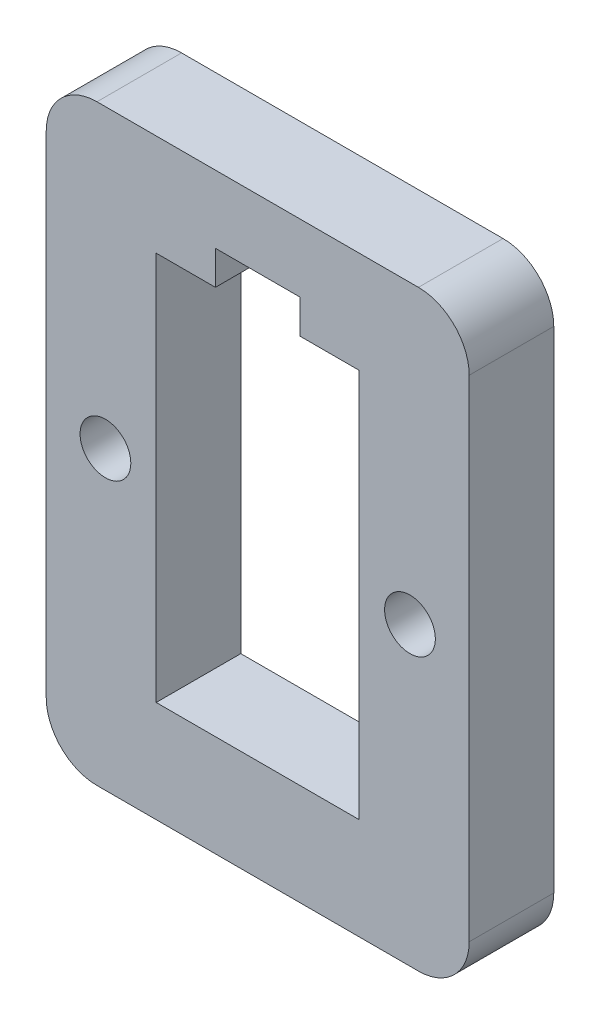
ISO-10303-21;
HEADER;
FILE_DESCRIPTION(('STEP AP214'),'2;1');
FILE_NAME('part.step','',(''),(''),'','','');
FILE_SCHEMA(('AUTOMOTIVE_DESIGN { 1 0 10303 214 1 1 1 1 }'));
ENDSEC;
DATA;
#1=APPLICATION_CONTEXT('core data for automotive mechanical design processes');
#2=APPLICATION_PROTOCOL_DEFINITION('international standard','automotive_design',2000,#1);
#3=PRODUCT_CONTEXT('',#1,'mechanical');
#4=PRODUCT('Part','Part','',(#3));
#5=PRODUCT_RELATED_PRODUCT_CATEGORY('part','',(#4));
#6=PRODUCT_DEFINITION_FORMATION('','',#4);
#7=PRODUCT_DEFINITION_CONTEXT('part definition',#1,'design');
#8=PRODUCT_DEFINITION('design','',#6,#7);
#9=PRODUCT_DEFINITION_SHAPE('','',#8);
#10=(LENGTH_UNIT() NAMED_UNIT(*) SI_UNIT(.MILLI.,.METRE.));
#11=(NAMED_UNIT(*) PLANE_ANGLE_UNIT() SI_UNIT($,.RADIAN.));
#12=(NAMED_UNIT(*) SI_UNIT($,.STERADIAN.) SOLID_ANGLE_UNIT());
#13=UNCERTAINTY_MEASURE_WITH_UNIT(LENGTH_MEASURE(1.E-05),#10,'distance_accuracy_value','');
#14=(GEOMETRIC_REPRESENTATION_CONTEXT(3) GLOBAL_UNCERTAINTY_ASSIGNED_CONTEXT((#13)) GLOBAL_UNIT_ASSIGNED_CONTEXT((#10,
#11,#12)) REPRESENTATION_CONTEXT('',''));
#15=CARTESIAN_POINT('',(0.,0.,0.));
#16=DIRECTION('',(0.,0.,1.));
#17=DIRECTION('',(1.,0.,0.));
#18=AXIS2_PLACEMENT_3D('',#15,#16,#17);
#19=CARTESIAN_POINT('',(2332.44024545616,1566.10008841039,5.));
#20=DIRECTION('',(0.,0.,1.));
#21=DIRECTION('',(1.,0.,0.));
#22=AXIS2_PLACEMENT_3D('',#19,#20,#21);
#23=PLANE('',#22);
#24=CARTESIAN_POINT('',(2313.94024545449,1580.60008840873,5.));
#25=DIRECTION('',(0.,0.,1.));
#26=DIRECTION('',(1.,0.,0.));
#27=AXIS2_PLACEMENT_3D('',#24,#25,#26);
#28=CIRCLE('',#27,1.50000000166674);
#29=CARTESIAN_POINT('',(2315.44024545616,1580.60008840873,5.));
#30=VERTEX_POINT('',#29);
#31=EDGE_CURVE('E201',#30,#30,#28,.T.);
#32=ORIENTED_EDGE('',*,*,#31,.F.);
#33=EDGE_LOOP('',(#32));
#34=FACE_BOUND('',#33,.T.);
#35=CARTESIAN_POINT('',(2332.44024545616,1566.10008841039,5.));
#36=DIRECTION('',(0.,0.,1.));
#37=DIRECTION('',(1.,0.,0.));
#38=AXIS2_PLACEMENT_3D('',#35,#36,#37);
#39=CIRCLE('',#38,3.00000000000011);
#40=CARTESIAN_POINT('',(2332.44024545616,1563.10008841039,5.));
#41=VERTEX_POINT('',#40);
#42=CARTESIAN_POINT('',(2335.44024545616,1566.10008841039,5.));
#43=VERTEX_POINT('',#42);
#44=EDGE_CURVE('E245',#41,#43,#39,.T.);
#45=ORIENTED_EDGE('',*,*,#44,.T.);
#46=DIRECTION('',(0.,1.,0.));
#47=VECTOR('',#46,1.);
#48=CARTESIAN_POINT('',(2335.44024545616,1595.10008841039,5.));
#49=LINE('',#48,#47);
#50=CARTESIAN_POINT('',(2335.44024545616,1595.10008841039,5.));
#51=VERTEX_POINT('',#50);
#52=EDGE_CURVE('E249',#43,#51,#49,.T.);
#53=ORIENTED_EDGE('',*,*,#52,.T.);
#54=CARTESIAN_POINT('',(2332.44024545616,1595.10008841039,5.));
#55=DIRECTION('',(0.,0.,1.));
#56=DIRECTION('',(1.,0.,0.));
#57=AXIS2_PLACEMENT_3D('',#54,#55,#56);
#58=CIRCLE('',#57,3.00000000000011);
#59=CARTESIAN_POINT('',(2332.44024545616,1598.10008841039,5.));
#60=VERTEX_POINT('',#59);
#61=EDGE_CURVE('E253',#51,#60,#58,.T.);
#62=ORIENTED_EDGE('',*,*,#61,.T.);
#63=DIRECTION('',(-1.,0.,0.));
#64=VECTOR('',#63,1.);
#65=CARTESIAN_POINT('',(2313.44024545616,1598.10008841039,5.));
#66=LINE('',#65,#64);
#67=CARTESIAN_POINT('',(2313.44024545616,1598.10008841039,5.));
#68=VERTEX_POINT('',#67);
#69=EDGE_CURVE('E256',#60,#68,#66,.T.);
#70=ORIENTED_EDGE('',*,*,#69,.T.);
#71=CARTESIAN_POINT('',(2313.44024545616,1595.10008841039,5.));
#72=DIRECTION('',(0.,0.,1.));
#73=DIRECTION('',(1.,0.,0.));
#74=AXIS2_PLACEMENT_3D('',#71,#72,#73);
#75=CIRCLE('',#74,3.00000000000011);
#76=CARTESIAN_POINT('',(2310.44024545616,1595.10008841039,5.));
#77=VERTEX_POINT('',#76);
#78=EDGE_CURVE('E259',#68,#77,#75,.T.);
#79=ORIENTED_EDGE('',*,*,#78,.T.);
#80=DIRECTION('',(0.,-1.,0.));
#81=VECTOR('',#80,1.);
#82=CARTESIAN_POINT('',(2310.44024545616,1566.10008841039,5.));
#83=LINE('',#82,#81);
#84=CARTESIAN_POINT('',(2310.44024545616,1566.10008841039,5.));
#85=VERTEX_POINT('',#84);
#86=EDGE_CURVE('E262',#77,#85,#83,.T.);
#87=ORIENTED_EDGE('',*,*,#86,.T.);
#88=CARTESIAN_POINT('',(2313.44024545616,1566.10008841039,5.));
#89=DIRECTION('',(0.,0.,1.));
#90=DIRECTION('',(1.,0.,0.));
#91=AXIS2_PLACEMENT_3D('',#88,#89,#90);
#92=CIRCLE('',#91,3.00000000000011);
#93=CARTESIAN_POINT('',(2313.44024545616,1563.10008841039,5.));
#94=VERTEX_POINT('',#93);
#95=EDGE_CURVE('E265',#85,#94,#92,.T.);
#96=ORIENTED_EDGE('',*,*,#95,.T.);
#97=DIRECTION('',(1.,0.,0.));
#98=VECTOR('',#97,1.);
#99=CARTESIAN_POINT('',(2332.44024545616,1563.10008841039,5.));
#100=LINE('',#99,#98);
#101=EDGE_CURVE('E268',#94,#41,#100,.T.);
#102=ORIENTED_EDGE('',*,*,#101,.T.);
#103=EDGE_LOOP('',(#45,#53,#62,#70,#79,#87,#96,#102));
#104=FACE_BOUND('',#103,.T.);
#105=DIRECTION('',(1.,0.,0.));
#106=VECTOR('',#105,1.);
#107=CARTESIAN_POINT('',(2316.94024545616,1569.10008841039,5.));
#108=LINE('',#107,#106);
#109=CARTESIAN_POINT('',(2316.94024545616,1569.10008841039,5.));
#110=VERTEX_POINT('',#109);
#111=CARTESIAN_POINT('',(2328.94024545616,1569.10008841039,5.));
#112=VERTEX_POINT('',#111);
#113=EDGE_CURVE('E162',#110,#112,#108,.T.);
#114=ORIENTED_EDGE('',*,*,#113,.F.);
#115=DIRECTION('',(0.,-1.,0.));
#116=VECTOR('',#115,1.);
#117=CARTESIAN_POINT('',(2316.94024545616,1592.10008841039,5.));
#118=LINE('',#117,#116);
#119=CARTESIAN_POINT('',(2316.94024545616,1592.10008841039,5.));
#120=VERTEX_POINT('',#119);
#121=EDGE_CURVE('E153',#120,#110,#118,.T.);
#122=ORIENTED_EDGE('',*,*,#121,.F.);
#123=DIRECTION('',(-1.,0.,0.));
#124=VECTOR('',#123,1.);
#125=CARTESIAN_POINT('',(2320.44024545616,1592.10008841039,5.));
#126=LINE('',#125,#124);
#127=CARTESIAN_POINT('',(2320.44024545616,1592.10008841039,5.));
#128=VERTEX_POINT('',#127);
#129=EDGE_CURVE('E196',#128,#120,#126,.T.);
#130=ORIENTED_EDGE('',*,*,#129,.F.);
#131=DIRECTION('',(0.,-1.,0.));
#132=VECTOR('',#131,1.);
#133=CARTESIAN_POINT('',(2320.44024545616,1594.10018841039,5.));
#134=LINE('',#133,#132);
#135=CARTESIAN_POINT('',(2320.44024545616,1594.10018841039,5.));
#136=VERTEX_POINT('',#135);
#137=EDGE_CURVE('E193',#136,#128,#134,.T.);
#138=ORIENTED_EDGE('',*,*,#137,.F.);
#139=DIRECTION('',(-1.,0.,0.));
#140=VECTOR('',#139,1.);
#141=CARTESIAN_POINT('',(2325.44024545616,1594.10018841039,5.));
#142=LINE('',#141,#140);
#143=CARTESIAN_POINT('',(2325.44024545616,1594.10018841039,5.));
#144=VERTEX_POINT('',#143);
#145=EDGE_CURVE('E190',#144,#136,#142,.T.);
#146=ORIENTED_EDGE('',*,*,#145,.F.);
#147=DIRECTION('',(0.,1.,0.));
#148=VECTOR('',#147,1.);
#149=CARTESIAN_POINT('',(2325.44024545616,1592.10008841039,5.));
#150=LINE('',#149,#148);
#151=CARTESIAN_POINT('',(2325.44024545616,1592.10008841039,5.));
#152=VERTEX_POINT('',#151);
#153=EDGE_CURVE('E187',#152,#144,#150,.T.);
#154=ORIENTED_EDGE('',*,*,#153,.F.);
#155=DIRECTION('',(-1.,0.,0.));
#156=VECTOR('',#155,1.);
#157=CARTESIAN_POINT('',(2328.94024545616,1592.10008841039,5.));
#158=LINE('',#157,#156);
#159=CARTESIAN_POINT('',(2328.94024545616,1592.10008841039,5.));
#160=VERTEX_POINT('',#159);
#161=EDGE_CURVE('E181',#160,#152,#158,.T.);
#162=ORIENTED_EDGE('',*,*,#161,.F.);
#163=DIRECTION('',(0.,1.,0.));
#164=VECTOR('',#163,1.);
#165=CARTESIAN_POINT('',(2328.94024545616,1569.10008841039,5.));
#166=LINE('',#165,#164);
#167=EDGE_CURVE('E177',#112,#160,#166,.T.);
#168=ORIENTED_EDGE('',*,*,#167,.F.);
#169=EDGE_LOOP('',(#114,#122,#130,#138,#146,#154,#162,#168));
#170=FACE_BOUND('',#169,.T.);
#171=CARTESIAN_POINT('',(2331.94024545449,1580.60008840873,5.));
#172=DIRECTION('',(0.,0.,1.));
#173=DIRECTION('',(1.,0.,0.));
#174=AXIS2_PLACEMENT_3D('',#171,#172,#173);
#175=CIRCLE('',#174,1.50000000166674);
#176=CARTESIAN_POINT('',(2333.44024545616,1580.60008840873,5.));
#177=VERTEX_POINT('',#176);
#178=EDGE_CURVE('E424',#177,#177,#175,.T.);
#179=ORIENTED_EDGE('',*,*,#178,.F.);
#180=EDGE_LOOP('',(#179));
#181=FACE_BOUND('',#180,.T.);
#182=ADVANCED_FACE('F39',(#34,#104,#170,#181),#23,.T.);
#183=CARTESIAN_POINT('',(2332.44024545616,1566.10008841039,0.));
#184=DIRECTION('',(0.,0.,1.));
#185=DIRECTION('',(1.,0.,0.));
#186=AXIS2_PLACEMENT_3D('',#183,#184,#185);
#187=PLANE('',#186);
#188=CARTESIAN_POINT('',(2332.44024545616,1566.10008841039,0.));
#189=DIRECTION('',(0.,0.,1.));
#190=DIRECTION('',(1.,0.,0.));
#191=AXIS2_PLACEMENT_3D('',#188,#189,#190);
#192=CIRCLE('',#191,3.00000000000011);
#193=CARTESIAN_POINT('',(2332.44024545616,1563.10008841039,0.));
#194=VERTEX_POINT('',#193);
#195=CARTESIAN_POINT('',(2335.44024545616,1566.10008841039,0.));
#196=VERTEX_POINT('',#195);
#197=EDGE_CURVE('E171',#194,#196,#192,.T.);
#198=ORIENTED_EDGE('',*,*,#197,.F.);
#199=DIRECTION('',(1.,0.,0.));
#200=VECTOR('',#199,1.);
#201=CARTESIAN_POINT('',(2332.44024545616,1563.10008841039,0.));
#202=LINE('',#201,#200);
#203=CARTESIAN_POINT('',(2313.44024545616,1563.10008841039,0.));
#204=VERTEX_POINT('',#203);
#205=EDGE_CURVE('E250',#204,#194,#202,.T.);
#206=ORIENTED_EDGE('',*,*,#205,.F.);
#207=CARTESIAN_POINT('',(2313.44024545616,1566.10008841039,0.));
#208=DIRECTION('',(0.,0.,1.));
#209=DIRECTION('',(1.,0.,0.));
#210=AXIS2_PLACEMENT_3D('',#207,#208,#209);
#211=CIRCLE('',#210,3.00000000000011);
#212=CARTESIAN_POINT('',(2310.44024545616,1566.10008841039,0.));
#213=VERTEX_POINT('',#212);
#214=EDGE_CURVE('E290',#213,#204,#211,.T.);
#215=ORIENTED_EDGE('',*,*,#214,.F.);
#216=DIRECTION('',(0.,-1.,0.));
#217=VECTOR('',#216,1.);
#218=CARTESIAN_POINT('',(2310.44024545616,1566.10008841039,0.));
#219=LINE('',#218,#217);
#220=CARTESIAN_POINT('',(2310.44024545616,1595.10008841039,0.));
#221=VERTEX_POINT('',#220);
#222=EDGE_CURVE('E287',#221,#213,#219,.T.);
#223=ORIENTED_EDGE('',*,*,#222,.F.);
#224=CARTESIAN_POINT('',(2313.44024545616,1595.10008841039,0.));
#225=DIRECTION('',(0.,0.,1.));
#226=DIRECTION('',(1.,0.,0.));
#227=AXIS2_PLACEMENT_3D('',#224,#225,#226);
#228=CIRCLE('',#227,3.00000000000011);
#229=CARTESIAN_POINT('',(2313.44024545616,1598.10008841039,0.));
#230=VERTEX_POINT('',#229);
#231=EDGE_CURVE('E284',#230,#221,#228,.T.);
#232=ORIENTED_EDGE('',*,*,#231,.F.);
#233=DIRECTION('',(-1.,0.,0.));
#234=VECTOR('',#233,1.);
#235=CARTESIAN_POINT('',(2313.44024545616,1598.10008841039,0.));
#236=LINE('',#235,#234);
#237=CARTESIAN_POINT('',(2332.44024545616,1598.10008841039,0.));
#238=VERTEX_POINT('',#237);
#239=EDGE_CURVE('E281',#238,#230,#236,.T.);
#240=ORIENTED_EDGE('',*,*,#239,.F.);
#241=CARTESIAN_POINT('',(2332.44024545616,1595.10008841039,0.));
#242=DIRECTION('',(0.,0.,1.));
#243=DIRECTION('',(1.,0.,0.));
#244=AXIS2_PLACEMENT_3D('',#241,#242,#243);
#245=CIRCLE('',#244,3.00000000000011);
#246=CARTESIAN_POINT('',(2335.44024545616,1595.10008841039,0.));
#247=VERTEX_POINT('',#246);
#248=EDGE_CURVE('E278',#247,#238,#245,.T.);
#249=ORIENTED_EDGE('',*,*,#248,.F.);
#250=DIRECTION('',(0.,1.,0.));
#251=VECTOR('',#250,1.);
#252=CARTESIAN_POINT('',(2335.44024545616,1595.10008841039,0.));
#253=LINE('',#252,#251);
#254=EDGE_CURVE('E275',#196,#247,#253,.T.);
#255=ORIENTED_EDGE('',*,*,#254,.F.);
#256=EDGE_LOOP('',(#198,#206,#215,#223,#232,#240,#249,#255));
#257=FACE_BOUND('',#256,.T.);
#258=DIRECTION('',(0.,-1.,0.));
#259=VECTOR('',#258,1.);
#260=CARTESIAN_POINT('',(2316.94024545616,1592.10008841039,0.));
#261=LINE('',#260,#259);
#262=CARTESIAN_POINT('',(2316.94024545616,1592.10008841039,0.));
#263=VERTEX_POINT('',#262);
#264=CARTESIAN_POINT('',(2316.94024545616,1569.10008841039,0.));
#265=VERTEX_POINT('',#264);
#266=EDGE_CURVE('E63',#263,#265,#261,.T.);
#267=ORIENTED_EDGE('',*,*,#266,.T.);
#268=DIRECTION('',(1.,0.,0.));
#269=VECTOR('',#268,1.);
#270=CARTESIAN_POINT('',(2316.94024545616,1569.10008841039,0.));
#271=LINE('',#270,#269);
#272=CARTESIAN_POINT('',(2328.94024545616,1569.10008841039,0.));
#273=VERTEX_POINT('',#272);
#274=EDGE_CURVE('E169',#265,#273,#271,.T.);
#275=ORIENTED_EDGE('',*,*,#274,.T.);
#276=DIRECTION('',(0.,1.,0.));
#277=VECTOR('',#276,1.);
#278=CARTESIAN_POINT('',(2328.94024545616,1569.10008841039,0.));
#279=LINE('',#278,#277);
#280=CARTESIAN_POINT('',(2328.94024545616,1592.10008841039,0.));
#281=VERTEX_POINT('',#280);
#282=EDGE_CURVE('E204',#273,#281,#279,.T.);
#283=ORIENTED_EDGE('',*,*,#282,.T.);
#284=DIRECTION('',(-1.,0.,0.));
#285=VECTOR('',#284,1.);
#286=CARTESIAN_POINT('',(2328.94024545616,1592.10008841039,0.));
#287=LINE('',#286,#285);
#288=CARTESIAN_POINT('',(2325.44024545616,1592.10008841039,0.));
#289=VERTEX_POINT('',#288);
#290=EDGE_CURVE('E208',#281,#289,#287,.T.);
#291=ORIENTED_EDGE('',*,*,#290,.T.);
#292=DIRECTION('',(0.,1.,0.));
#293=VECTOR('',#292,1.);
#294=CARTESIAN_POINT('',(2325.44024545616,1592.10008841039,0.));
#295=LINE('',#294,#293);
#296=CARTESIAN_POINT('',(2325.44024545616,1594.10018841039,0.));
#297=VERTEX_POINT('',#296);
#298=EDGE_CURVE('E212',#289,#297,#295,.T.);
#299=ORIENTED_EDGE('',*,*,#298,.T.);
#300=DIRECTION('',(-1.,0.,0.));
#301=VECTOR('',#300,1.);
#302=CARTESIAN_POINT('',(2325.44024545616,1594.10018841039,0.));
#303=LINE('',#302,#301);
#304=CARTESIAN_POINT('',(2320.44024545616,1594.10018841039,0.));
#305=VERTEX_POINT('',#304);
#306=EDGE_CURVE('E216',#297,#305,#303,.T.);
#307=ORIENTED_EDGE('',*,*,#306,.T.);
#308=DIRECTION('',(0.,-1.,0.));
#309=VECTOR('',#308,1.);
#310=CARTESIAN_POINT('',(2320.44024545616,1594.10018841039,0.));
#311=LINE('',#310,#309);
#312=CARTESIAN_POINT('',(2320.44024545616,1592.10008841039,0.));
#313=VERTEX_POINT('',#312);
#314=EDGE_CURVE('E220',#305,#313,#311,.T.);
#315=ORIENTED_EDGE('',*,*,#314,.T.);
#316=DIRECTION('',(-1.,0.,0.));
#317=VECTOR('',#316,1.);
#318=CARTESIAN_POINT('',(2320.44024545616,1592.10008841039,0.));
#319=LINE('',#318,#317);
#320=EDGE_CURVE('E163',#313,#263,#319,.T.);
#321=ORIENTED_EDGE('',*,*,#320,.T.);
#322=EDGE_LOOP('',(#267,#275,#283,#291,#299,#307,#315,#321));
#323=FACE_BOUND('',#322,.T.);
#324=CARTESIAN_POINT('',(2313.94024545449,1580.60008840873,0.));
#325=DIRECTION('',(0.,0.,1.));
#326=DIRECTION('',(1.,0.,0.));
#327=AXIS2_PLACEMENT_3D('',#324,#325,#326);
#328=CIRCLE('',#327,1.50000000166674);
#329=CARTESIAN_POINT('',(2315.44024545616,1580.60008840873,0.));
#330=VERTEX_POINT('',#329);
#331=EDGE_CURVE('E432',#330,#330,#328,.T.);
#332=ORIENTED_EDGE('',*,*,#331,.T.);
#333=EDGE_LOOP('',(#332));
#334=FACE_BOUND('',#333,.T.);
#335=CARTESIAN_POINT('',(2331.94024545449,1580.60008840873,0.));
#336=DIRECTION('',(0.,0.,1.));
#337=DIRECTION('',(1.,0.,0.));
#338=AXIS2_PLACEMENT_3D('',#335,#336,#337);
#339=CIRCLE('',#338,1.50000000166674);
#340=CARTESIAN_POINT('',(2333.44024545616,1580.60008840873,0.));
#341=VERTEX_POINT('',#340);
#342=EDGE_CURVE('E427',#341,#341,#339,.T.);
#343=ORIENTED_EDGE('',*,*,#342,.T.);
#344=EDGE_LOOP('',(#343));
#345=FACE_BOUND('',#344,.T.);
#346=ADVANCED_FACE('F329',(#257,#323,#334,#345),#187,.F.);
#347=CARTESIAN_POINT('',(2332.44024545616,1566.10008841039,5.));
#348=DIRECTION('',(0.,0.,-1.));
#349=DIRECTION('',(-1.,0.,0.));
#350=AXIS2_PLACEMENT_3D('',#347,#348,#349);
#351=CYLINDRICAL_SURFACE('',#350,3.00000000000011);
#352=ORIENTED_EDGE('',*,*,#197,.T.);
#353=DIRECTION('',(0.,0.,-1.));
#354=VECTOR('',#353,1.);
#355=CARTESIAN_POINT('',(2335.44024545616,1566.10008841039,5.));
#356=LINE('',#355,#354);
#357=EDGE_CURVE('E11',#43,#196,#356,.T.);
#358=ORIENTED_EDGE('',*,*,#357,.F.);
#359=ORIENTED_EDGE('',*,*,#44,.F.);
#360=DIRECTION('',(0.,0.,-1.));
#361=VECTOR('',#360,1.);
#362=CARTESIAN_POINT('',(2332.44024545616,1563.10008841039,5.));
#363=LINE('',#362,#361);
#364=EDGE_CURVE('E271',#41,#194,#363,.T.);
#365=ORIENTED_EDGE('',*,*,#364,.T.);
#366=EDGE_LOOP('',(#352,#358,#359,#365));
#367=FACE_BOUND('',#366,.T.);
#368=ADVANCED_FACE('F41',(#367),#351,.T.);
#369=CARTESIAN_POINT('',(2335.44024545616,1595.10008841039,5.));
#370=DIRECTION('',(-1.,0.,0.));
#371=DIRECTION('',(0.,0.,1.));
#372=AXIS2_PLACEMENT_3D('',#369,#370,#371);
#373=PLANE('',#372);
#374=ORIENTED_EDGE('',*,*,#254,.T.);
#375=DIRECTION('',(0.,0.,-1.));
#376=VECTOR('',#375,1.);
#377=CARTESIAN_POINT('',(2335.44024545616,1595.10008841039,5.));
#378=LINE('',#377,#376);
#379=EDGE_CURVE('E48',#51,#247,#378,.T.);
#380=ORIENTED_EDGE('',*,*,#379,.F.);
#381=ORIENTED_EDGE('',*,*,#52,.F.);
#382=ORIENTED_EDGE('',*,*,#357,.T.);
#383=EDGE_LOOP('',(#374,#380,#381,#382));
#384=FACE_BOUND('',#383,.T.);
#385=ADVANCED_FACE('F346',(#384),#373,.F.);
#386=CARTESIAN_POINT('',(2332.44024545616,1595.10008841039,5.));
#387=DIRECTION('',(0.,0.,-1.));
#388=DIRECTION('',(-1.,0.,0.));
#389=AXIS2_PLACEMENT_3D('',#386,#387,#388);
#390=CYLINDRICAL_SURFACE('',#389,3.00000000000011);
#391=ORIENTED_EDGE('',*,*,#248,.T.);
#392=DIRECTION('',(0.,0.,-1.));
#393=VECTOR('',#392,1.);
#394=CARTESIAN_POINT('',(2332.44024545616,1598.10008841039,5.));
#395=LINE('',#394,#393);
#396=EDGE_CURVE('E314',#60,#238,#395,.T.);
#397=ORIENTED_EDGE('',*,*,#396,.F.);
#398=ORIENTED_EDGE('',*,*,#61,.F.);
#399=ORIENTED_EDGE('',*,*,#379,.T.);
#400=EDGE_LOOP('',(#391,#397,#398,#399));
#401=FACE_BOUND('',#400,.T.);
#402=ADVANCED_FACE('F323',(#401),#390,.T.);
#403=CARTESIAN_POINT('',(2313.44024545616,1598.10008841039,5.));
#404=DIRECTION('',(0.,-1.,0.));
#405=DIRECTION('',(0.,0.,-1.));
#406=AXIS2_PLACEMENT_3D('',#403,#404,#405);
#407=PLANE('',#406);
#408=ORIENTED_EDGE('',*,*,#239,.T.);
#409=DIRECTION('',(0.,0.,-1.));
#410=VECTOR('',#409,1.);
#411=CARTESIAN_POINT('',(2313.44024545616,1598.10008841039,5.));
#412=LINE('',#411,#410);
#413=EDGE_CURVE('E310',#68,#230,#412,.T.);
#414=ORIENTED_EDGE('',*,*,#413,.F.);
#415=ORIENTED_EDGE('',*,*,#69,.F.);
#416=ORIENTED_EDGE('',*,*,#396,.T.);
#417=EDGE_LOOP('',(#408,#414,#415,#416));
#418=FACE_BOUND('',#417,.T.);
#419=ADVANCED_FACE('F335',(#418),#407,.F.);
#420=CARTESIAN_POINT('',(2313.44024545616,1595.10008841039,5.));
#421=DIRECTION('',(0.,0.,-1.));
#422=DIRECTION('',(-1.,0.,0.));
#423=AXIS2_PLACEMENT_3D('',#420,#421,#422);
#424=CYLINDRICAL_SURFACE('',#423,3.00000000000011);
#425=ORIENTED_EDGE('',*,*,#231,.T.);
#426=DIRECTION('',(0.,0.,-1.));
#427=VECTOR('',#426,1.);
#428=CARTESIAN_POINT('',(2310.44024545616,1595.10008841039,5.));
#429=LINE('',#428,#427);
#430=EDGE_CURVE('E306',#77,#221,#429,.T.);
#431=ORIENTED_EDGE('',*,*,#430,.F.);
#432=ORIENTED_EDGE('',*,*,#78,.F.);
#433=ORIENTED_EDGE('',*,*,#413,.T.);
#434=EDGE_LOOP('',(#425,#431,#432,#433));
#435=FACE_BOUND('',#434,.T.);
#436=ADVANCED_FACE('F339',(#435),#424,.T.);
#437=CARTESIAN_POINT('',(2310.44024545616,1566.10008841039,5.));
#438=DIRECTION('',(1.,0.,0.));
#439=DIRECTION('',(0.,0.,-1.));
#440=AXIS2_PLACEMENT_3D('',#437,#438,#439);
#441=PLANE('',#440);
#442=ORIENTED_EDGE('',*,*,#222,.T.);
#443=DIRECTION('',(0.,0.,-1.));
#444=VECTOR('',#443,1.);
#445=CARTESIAN_POINT('',(2310.44024545616,1566.10008841039,5.));
#446=LINE('',#445,#444);
#447=EDGE_CURVE('E302',#85,#213,#446,.T.);
#448=ORIENTED_EDGE('',*,*,#447,.F.);
#449=ORIENTED_EDGE('',*,*,#86,.F.);
#450=ORIENTED_EDGE('',*,*,#430,.T.);
#451=EDGE_LOOP('',(#442,#448,#449,#450));
#452=FACE_BOUND('',#451,.T.);
#453=ADVANCED_FACE('F359',(#452),#441,.F.);
#454=CARTESIAN_POINT('',(2313.44024545616,1566.10008841039,5.));
#455=DIRECTION('',(0.,0.,-1.));
#456=DIRECTION('',(-1.,0.,0.));
#457=AXIS2_PLACEMENT_3D('',#454,#455,#456);
#458=CYLINDRICAL_SURFACE('',#457,3.00000000000011);
#459=ORIENTED_EDGE('',*,*,#214,.T.);
#460=DIRECTION('',(0.,0.,-1.));
#461=VECTOR('',#460,1.);
#462=CARTESIAN_POINT('',(2313.44024545616,1563.10008841039,5.));
#463=LINE('',#462,#461);
#464=EDGE_CURVE('E298',#94,#204,#463,.T.);
#465=ORIENTED_EDGE('',*,*,#464,.F.);
#466=ORIENTED_EDGE('',*,*,#95,.F.);
#467=ORIENTED_EDGE('',*,*,#447,.T.);
#468=EDGE_LOOP('',(#459,#465,#466,#467));
#469=FACE_BOUND('',#468,.T.);
#470=ADVANCED_FACE('F357',(#469),#458,.T.);
#471=CARTESIAN_POINT('',(2332.44024545616,1563.10008841039,5.));
#472=DIRECTION('',(0.,1.,0.));
#473=DIRECTION('',(0.,0.,1.));
#474=AXIS2_PLACEMENT_3D('',#471,#472,#473);
#475=PLANE('',#474);
#476=ORIENTED_EDGE('',*,*,#205,.T.);
#477=ORIENTED_EDGE('',*,*,#364,.F.);
#478=ORIENTED_EDGE('',*,*,#101,.F.);
#479=ORIENTED_EDGE('',*,*,#464,.T.);
#480=EDGE_LOOP('',(#476,#477,#478,#479));
#481=FACE_BOUND('',#480,.T.);
#482=ADVANCED_FACE('F352',(#481),#475,.F.);
#483=CARTESIAN_POINT('',(2316.94024545616,1592.10008841039,5.));
#484=DIRECTION('',(1.,0.,0.));
#485=DIRECTION('',(0.,0.,-1.));
#486=AXIS2_PLACEMENT_3D('',#483,#484,#485);
#487=PLANE('',#486);
#488=ORIENTED_EDGE('',*,*,#266,.F.);
#489=DIRECTION('',(0.,0.,-1.));
#490=VECTOR('',#489,1.);
#491=CARTESIAN_POINT('',(2316.94024545616,1592.10008841039,5.));
#492=LINE('',#491,#490);
#493=EDGE_CURVE('E157',#120,#263,#492,.T.);
#494=ORIENTED_EDGE('',*,*,#493,.F.);
#495=ORIENTED_EDGE('',*,*,#121,.T.);
#496=DIRECTION('',(0.,0.,-1.));
#497=VECTOR('',#496,1.);
#498=CARTESIAN_POINT('',(2316.94024545616,1569.10008841039,5.));
#499=LINE('',#498,#497);
#500=EDGE_CURVE('E156',#110,#265,#499,.T.);
#501=ORIENTED_EDGE('',*,*,#500,.T.);
#502=EDGE_LOOP('',(#488,#494,#495,#501));
#503=FACE_BOUND('',#502,.T.);
#504=ADVANCED_FACE('F155',(#503),#487,.T.);
#505=CARTESIAN_POINT('',(2316.94024545616,1569.10008841039,5.));
#506=DIRECTION('',(0.,1.,0.));
#507=DIRECTION('',(0.,0.,1.));
#508=AXIS2_PLACEMENT_3D('',#505,#506,#507);
#509=PLANE('',#508);
#510=ORIENTED_EDGE('',*,*,#274,.F.);
#511=ORIENTED_EDGE('',*,*,#500,.F.);
#512=ORIENTED_EDGE('',*,*,#113,.T.);
#513=DIRECTION('',(0.,0.,-1.));
#514=VECTOR('',#513,1.);
#515=CARTESIAN_POINT('',(2328.94024545616,1569.10008841039,5.));
#516=LINE('',#515,#514);
#517=EDGE_CURVE('E172',#112,#273,#516,.T.);
#518=ORIENTED_EDGE('',*,*,#517,.T.);
#519=EDGE_LOOP('',(#510,#511,#512,#518));
#520=FACE_BOUND('',#519,.T.);
#521=ADVANCED_FACE('F166',(#520),#509,.T.);
#522=CARTESIAN_POINT('',(2328.94024545616,1569.10008841039,5.));
#523=DIRECTION('',(-1.,0.,0.));
#524=DIRECTION('',(0.,0.,1.));
#525=AXIS2_PLACEMENT_3D('',#522,#523,#524);
#526=PLANE('',#525);
#527=ORIENTED_EDGE('',*,*,#282,.F.);
#528=ORIENTED_EDGE('',*,*,#517,.F.);
#529=ORIENTED_EDGE('',*,*,#167,.T.);
#530=DIRECTION('',(0.,0.,-1.));
#531=VECTOR('',#530,1.);
#532=CARTESIAN_POINT('',(2328.94024545616,1592.10008841039,5.));
#533=LINE('',#532,#531);
#534=EDGE_CURVE('E240',#160,#281,#533,.T.);
#535=ORIENTED_EDGE('',*,*,#534,.T.);
#536=EDGE_LOOP('',(#527,#528,#529,#535));
#537=FACE_BOUND('',#536,.T.);
#538=ADVANCED_FACE('F386',(#537),#526,.T.);
#539=CARTESIAN_POINT('',(2328.94024545616,1592.10008841039,5.));
#540=DIRECTION('',(0.,-1.,0.));
#541=DIRECTION('',(0.,0.,-1.));
#542=AXIS2_PLACEMENT_3D('',#539,#540,#541);
#543=PLANE('',#542);
#544=ORIENTED_EDGE('',*,*,#290,.F.);
#545=ORIENTED_EDGE('',*,*,#534,.F.);
#546=ORIENTED_EDGE('',*,*,#161,.T.);
#547=DIRECTION('',(0.,0.,-1.));
#548=VECTOR('',#547,1.);
#549=CARTESIAN_POINT('',(2325.44024545616,1592.10008841039,5.));
#550=LINE('',#549,#548);
#551=EDGE_CURVE('E237',#152,#289,#550,.T.);
#552=ORIENTED_EDGE('',*,*,#551,.T.);
#553=EDGE_LOOP('',(#544,#545,#546,#552));
#554=FACE_BOUND('',#553,.T.);
#555=ADVANCED_FACE('F390',(#554),#543,.T.);
#556=CARTESIAN_POINT('',(2325.44024545616,1592.10008841039,5.));
#557=DIRECTION('',(-1.,0.,0.));
#558=DIRECTION('',(0.,0.,1.));
#559=AXIS2_PLACEMENT_3D('',#556,#557,#558);
#560=PLANE('',#559);
#561=ORIENTED_EDGE('',*,*,#298,.F.);
#562=ORIENTED_EDGE('',*,*,#551,.F.);
#563=ORIENTED_EDGE('',*,*,#153,.T.);
#564=DIRECTION('',(0.,0.,-1.));
#565=VECTOR('',#564,1.);
#566=CARTESIAN_POINT('',(2325.44024545616,1594.10018841039,5.));
#567=LINE('',#566,#565);
#568=EDGE_CURVE('E234',#144,#297,#567,.T.);
#569=ORIENTED_EDGE('',*,*,#568,.T.);
#570=EDGE_LOOP('',(#561,#562,#563,#569));
#571=FACE_BOUND('',#570,.T.);
#572=ADVANCED_FACE('F396',(#571),#560,.T.);
#573=CARTESIAN_POINT('',(2325.44024545616,1594.10018841039,5.));
#574=DIRECTION('',(0.,-1.,0.));
#575=DIRECTION('',(0.,0.,-1.));
#576=AXIS2_PLACEMENT_3D('',#573,#574,#575);
#577=PLANE('',#576);
#578=ORIENTED_EDGE('',*,*,#306,.F.);
#579=ORIENTED_EDGE('',*,*,#568,.F.);
#580=ORIENTED_EDGE('',*,*,#145,.T.);
#581=DIRECTION('',(0.,0.,-1.));
#582=VECTOR('',#581,1.);
#583=CARTESIAN_POINT('',(2320.44024545616,1594.10018841039,5.));
#584=LINE('',#583,#582);
#585=EDGE_CURVE('E231',#136,#305,#584,.T.);
#586=ORIENTED_EDGE('',*,*,#585,.T.);
#587=EDGE_LOOP('',(#578,#579,#580,#586));
#588=FACE_BOUND('',#587,.T.);
#589=ADVANCED_FACE('F400',(#588),#577,.T.);
#590=CARTESIAN_POINT('',(2320.44024545616,1594.10018841039,5.));
#591=DIRECTION('',(1.,0.,0.));
#592=DIRECTION('',(0.,0.,-1.));
#593=AXIS2_PLACEMENT_3D('',#590,#591,#592);
#594=PLANE('',#593);
#595=ORIENTED_EDGE('',*,*,#314,.F.);
#596=ORIENTED_EDGE('',*,*,#585,.F.);
#597=ORIENTED_EDGE('',*,*,#137,.T.);
#598=DIRECTION('',(0.,0.,-1.));
#599=VECTOR('',#598,1.);
#600=CARTESIAN_POINT('',(2320.44024545616,1592.10008841039,5.));
#601=LINE('',#600,#599);
#602=EDGE_CURVE('E55',#128,#313,#601,.T.);
#603=ORIENTED_EDGE('',*,*,#602,.T.);
#604=EDGE_LOOP('',(#595,#596,#597,#603));
#605=FACE_BOUND('',#604,.T.);
#606=ADVANCED_FACE('F404',(#605),#594,.T.);
#607=CARTESIAN_POINT('',(2320.44024545616,1592.10008841039,5.));
#608=DIRECTION('',(0.,-1.,0.));
#609=DIRECTION('',(0.,0.,-1.));
#610=AXIS2_PLACEMENT_3D('',#607,#608,#609);
#611=PLANE('',#610);
#612=ORIENTED_EDGE('',*,*,#320,.F.);
#613=ORIENTED_EDGE('',*,*,#602,.F.);
#614=ORIENTED_EDGE('',*,*,#129,.T.);
#615=ORIENTED_EDGE('',*,*,#493,.T.);
#616=EDGE_LOOP('',(#612,#613,#614,#615));
#617=FACE_BOUND('',#616,.T.);
#618=ADVANCED_FACE('F408',(#617),#611,.T.);
#619=CARTESIAN_POINT('',(2313.94024545449,1580.60008840873,5.));
#620=DIRECTION('',(0.,0.,-1.));
#621=DIRECTION('',(-1.,0.,0.));
#622=AXIS2_PLACEMENT_3D('',#619,#620,#621);
#623=CYLINDRICAL_SURFACE('',#622,1.50000000166674);
#624=ORIENTED_EDGE('',*,*,#31,.T.);
#625=EDGE_LOOP('',(#624));
#626=FACE_BOUND('',#625,.T.);
#627=ORIENTED_EDGE('',*,*,#331,.F.);
#628=EDGE_LOOP('',(#627));
#629=FACE_BOUND('',#628,.T.);
#630=ADVANCED_FACE('F412',(#626,#629),#623,.F.);
#631=CARTESIAN_POINT('',(2331.94024545449,1580.60008840873,5.));
#632=DIRECTION('',(0.,0.,-1.));
#633=DIRECTION('',(-1.,0.,0.));
#634=AXIS2_PLACEMENT_3D('',#631,#632,#633);
#635=CYLINDRICAL_SURFACE('',#634,1.50000000166674);
#636=ORIENTED_EDGE('',*,*,#178,.T.);
#637=EDGE_LOOP('',(#636));
#638=FACE_BOUND('',#637,.T.);
#639=ORIENTED_EDGE('',*,*,#342,.F.);
#640=EDGE_LOOP('',(#639));
#641=FACE_BOUND('',#640,.T.);
#642=ADVANCED_FACE('F415',(#638,#641),#635,.F.);
#643=CLOSED_SHELL('',(#182,#346,#368,#385,#402,#419,#436,#453,#470,#482,#504,#521,#538,#555,
#572,#589,#606,#618,#630,#642));
#644=MANIFOLD_SOLID_BREP('B2',#643);
#645=ADVANCED_BREP_SHAPE_REPRESENTATION('',(#18,#644),#14);
#646=SHAPE_DEFINITION_REPRESENTATION(#9,#645);
ENDSEC;
END-ISO-10303-21;
